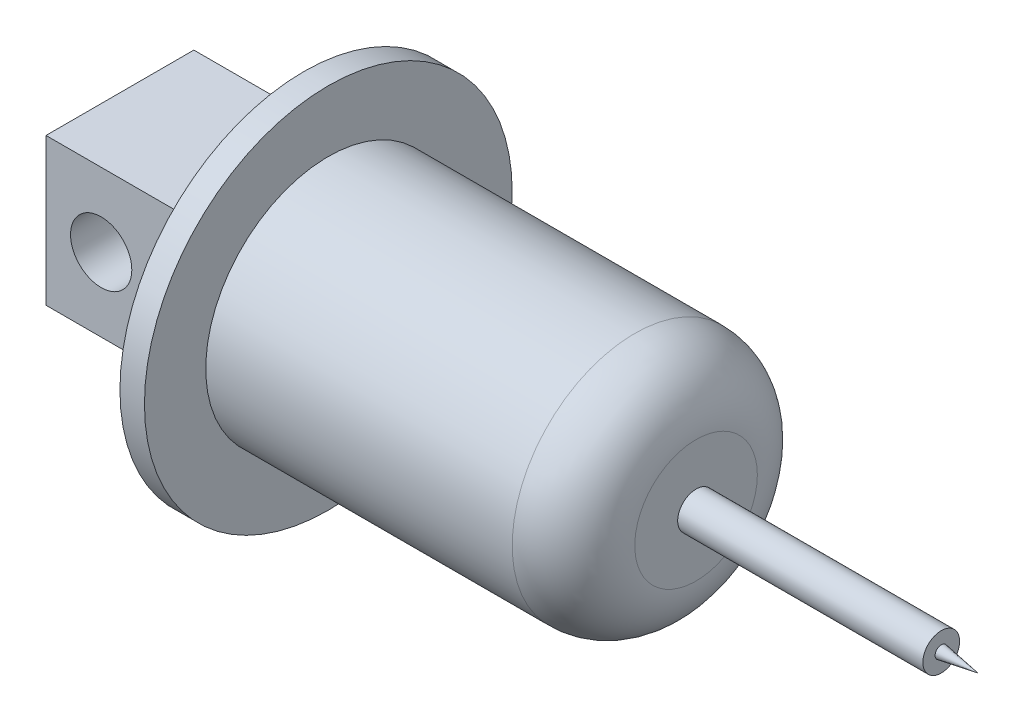
ISO-10303-21;
HEADER;
FILE_DESCRIPTION(('STEP AP214'),'2;1');
FILE_NAME('part.step','',(''),(''),'','','');
FILE_SCHEMA(('AUTOMOTIVE_DESIGN { 1 0 10303 214 1 1 1 1 }'));
ENDSEC;
DATA;
#1=APPLICATION_CONTEXT('core data for automotive mechanical design processes');
#2=APPLICATION_PROTOCOL_DEFINITION('international standard','automotive_design',2000,#1);
#3=PRODUCT_CONTEXT('',#1,'mechanical');
#4=PRODUCT('Part','Part','',(#3));
#5=PRODUCT_RELATED_PRODUCT_CATEGORY('part','',(#4));
#6=PRODUCT_DEFINITION_FORMATION('','',#4);
#7=PRODUCT_DEFINITION_CONTEXT('part definition',#1,'design');
#8=PRODUCT_DEFINITION('design','',#6,#7);
#9=PRODUCT_DEFINITION_SHAPE('','',#8);
#10=(LENGTH_UNIT() NAMED_UNIT(*) SI_UNIT(.MILLI.,.METRE.));
#11=(NAMED_UNIT(*) PLANE_ANGLE_UNIT() SI_UNIT($,.RADIAN.));
#12=(NAMED_UNIT(*) SI_UNIT($,.STERADIAN.) SOLID_ANGLE_UNIT());
#13=UNCERTAINTY_MEASURE_WITH_UNIT(LENGTH_MEASURE(1.E-05),#10,'distance_accuracy_value','');
#14=(GEOMETRIC_REPRESENTATION_CONTEXT(3) GLOBAL_UNCERTAINTY_ASSIGNED_CONTEXT((#13)) GLOBAL_UNIT_ASSIGNED_CONTEXT((#10,
#11,#12)) REPRESENTATION_CONTEXT('',''));
#15=CARTESIAN_POINT('',(0.,0.,0.));
#16=DIRECTION('',(0.,0.,1.));
#17=DIRECTION('',(1.,0.,0.));
#18=AXIS2_PLACEMENT_3D('',#15,#16,#17);
#19=CARTESIAN_POINT('',(-20.,0.,0.));
#20=DIRECTION('',(-1.,0.,0.));
#21=DIRECTION('',(0.,0.,1.));
#22=AXIS2_PLACEMENT_3D('',#19,#20,#21);
#23=CYLINDRICAL_SURFACE('',#22,10.);
#24=CARTESIAN_POINT('',(-25.,0.,0.));
#25=DIRECTION('',(1.,0.,0.));
#26=DIRECTION('',(0.,0.,-1.));
#27=AXIS2_PLACEMENT_3D('',#24,#25,#26);
#28=CIRCLE('',#27,10.);
#29=CARTESIAN_POINT('',(-25.,0.,-9.99999999999991));
#30=VERTEX_POINT('',#29);
#31=EDGE_CURVE('E11',#30,#30,#28,.F.);
#32=ORIENTED_EDGE('',*,*,#31,.T.);
#33=EDGE_LOOP('',(#32));
#34=FACE_BOUND('',#33,.T.);
#35=CARTESIAN_POINT('',(-50.,0.,1.74894432217042E-13));
#36=DIRECTION('',(1.,0.,0.));
#37=DIRECTION('',(0.,0.,-1.));
#38=AXIS2_PLACEMENT_3D('',#35,#36,#37);
#39=CIRCLE('',#38,10.);
#40=CARTESIAN_POINT('',(-50.,0.,-9.99999999999982));
#41=VERTEX_POINT('',#40);
#42=EDGE_CURVE('E166',#41,#41,#39,.T.);
#43=ORIENTED_EDGE('',*,*,#42,.T.);
#44=EDGE_LOOP('',(#43));
#45=FACE_BOUND('',#44,.T.);
#46=ADVANCED_FACE('F33',(#34,#45),#23,.T.);
#47=CARTESIAN_POINT('',(-20.,0.,0.));
#48=DIRECTION('',(1.,0.,0.));
#49=DIRECTION('',(0.,0.,-1.));
#50=AXIS2_PLACEMENT_3D('',#47,#48,#49);
#51=PLANE('',#50);
#52=CARTESIAN_POINT('',(-20.,0.,0.));
#53=DIRECTION('',(1.,0.,0.));
#54=DIRECTION('',(0.,0.,-1.));
#55=AXIS2_PLACEMENT_3D('',#52,#53,#54);
#56=CIRCLE('',#55,1.5);
#57=CARTESIAN_POINT('',(-20.,0.,-1.49999999999993));
#58=VERTEX_POINT('',#57);
#59=EDGE_CURVE('E149',#58,#58,#56,.T.);
#60=ORIENTED_EDGE('',*,*,#59,.F.);
#61=EDGE_LOOP('',(#60));
#62=FACE_BOUND('',#61,.T.);
#63=CARTESIAN_POINT('',(-20.,0.,0.));
#64=DIRECTION('',(1.,0.,0.));
#65=DIRECTION('',(0.,0.,-1.));
#66=AXIS2_PLACEMENT_3D('',#63,#64,#65);
#67=CIRCLE('',#66,5.);
#68=CARTESIAN_POINT('',(-20.,0.,-4.99999999999993));
#69=VERTEX_POINT('',#68);
#70=EDGE_CURVE('E41',#69,#69,#67,.T.);
#71=ORIENTED_EDGE('',*,*,#70,.T.);
#72=EDGE_LOOP('',(#71));
#73=FACE_BOUND('',#72,.T.);
#74=ADVANCED_FACE('F86',(#62,#73),#51,.T.);
#75=CARTESIAN_POINT('',(-52.,0.,1.81877394894729E-13));
#76=DIRECTION('',(1.,0.,0.));
#77=DIRECTION('',(0.,0.,-1.));
#78=AXIS2_PLACEMENT_3D('',#75,#76,#77);
#79=CYLINDRICAL_SURFACE('',#78,15.);
#80=CARTESIAN_POINT('',(-52.,0.,1.81877394894729E-13));
#81=DIRECTION('',(-1.,0.,0.));
#82=DIRECTION('',(0.,0.,1.));
#83=AXIS2_PLACEMENT_3D('',#80,#81,#82);
#84=CIRCLE('',#83,15.);
#85=CARTESIAN_POINT('',(-52.,0.,15.0000000000002));
#86=VERTEX_POINT('',#85);
#87=EDGE_CURVE('E163',#86,#86,#84,.T.);
#88=ORIENTED_EDGE('',*,*,#87,.F.);
#89=EDGE_LOOP('',(#88));
#90=FACE_BOUND('',#89,.T.);
#91=CARTESIAN_POINT('',(-50.,0.,1.74894432217042E-13));
#92=DIRECTION('',(-1.,0.,0.));
#93=DIRECTION('',(0.,0.,1.));
#94=AXIS2_PLACEMENT_3D('',#91,#92,#93);
#95=CIRCLE('',#94,15.);
#96=CARTESIAN_POINT('',(-50.,0.,15.0000000000002));
#97=VERTEX_POINT('',#96);
#98=EDGE_CURVE('E161',#97,#97,#95,.T.);
#99=ORIENTED_EDGE('',*,*,#98,.T.);
#100=EDGE_LOOP('',(#99));
#101=FACE_BOUND('',#100,.T.);
#102=ADVANCED_FACE('F91',(#90,#101),#79,.T.);
#103=CARTESIAN_POINT('',(-52.,0.,1.81877394894729E-13));
#104=DIRECTION('',(-1.,0.,0.));
#105=DIRECTION('',(0.,0.,1.));
#106=AXIS2_PLACEMENT_3D('',#103,#104,#105);
#107=PLANE('',#106);
#108=DIRECTION('',(0.,-1.,0.));
#109=VECTOR('',#108,1.);
#110=CARTESIAN_POINT('',(-52.,-6.,-6.03128939533191));
#111=LINE('',#110,#109);
#112=CARTESIAN_POINT('',(-52.,6.,-6.03128939533191));
#113=VERTEX_POINT('',#112);
#114=CARTESIAN_POINT('',(-52.,-6.,-6.03128939533191));
#115=VERTEX_POINT('',#114);
#116=EDGE_CURVE('E48',#113,#115,#111,.T.);
#117=ORIENTED_EDGE('',*,*,#116,.F.);
#118=DIRECTION('',(0.,0.,-1.));
#119=VECTOR('',#118,1.);
#120=CARTESIAN_POINT('',(-52.,6.,6.03128939533228));
#121=LINE('',#120,#119);
#122=CARTESIAN_POINT('',(-52.,6.,6.03128939533228));
#123=VERTEX_POINT('',#122);
#124=EDGE_CURVE('E52',#123,#113,#121,.T.);
#125=ORIENTED_EDGE('',*,*,#124,.F.);
#126=DIRECTION('',(0.,1.,0.));
#127=VECTOR('',#126,1.);
#128=CARTESIAN_POINT('',(-52.,-6.,6.03128939533228));
#129=LINE('',#128,#127);
#130=CARTESIAN_POINT('',(-52.,-6.,6.03128939533228));
#131=VERTEX_POINT('',#130);
#132=EDGE_CURVE('E276',#131,#123,#129,.T.);
#133=ORIENTED_EDGE('',*,*,#132,.F.);
#134=DIRECTION('',(0.,0.,1.));
#135=VECTOR('',#134,1.);
#136=CARTESIAN_POINT('',(-52.,-6.,6.03128939533228));
#137=LINE('',#136,#135);
#138=EDGE_CURVE('E278',#115,#131,#137,.T.);
#139=ORIENTED_EDGE('',*,*,#138,.F.);
#140=EDGE_LOOP('',(#117,#125,#133,#139));
#141=FACE_BOUND('',#140,.T.);
#142=ORIENTED_EDGE('',*,*,#87,.T.);
#143=EDGE_LOOP('',(#142));
#144=FACE_BOUND('',#143,.T.);
#145=ADVANCED_FACE('F98',(#141,#144),#107,.T.);
#146=CARTESIAN_POINT('',(-50.,0.,1.74894432217042E-13));
#147=DIRECTION('',(-1.,0.,0.));
#148=DIRECTION('',(0.,0.,1.));
#149=AXIS2_PLACEMENT_3D('',#146,#147,#148);
#150=PLANE('',#149);
#151=ORIENTED_EDGE('',*,*,#42,.F.);
#152=EDGE_LOOP('',(#151));
#153=FACE_BOUND('',#152,.T.);
#154=ORIENTED_EDGE('',*,*,#98,.F.);
#155=EDGE_LOOP('',(#154));
#156=FACE_BOUND('',#155,.T.);
#157=ADVANCED_FACE('F100',(#153,#156),#150,.F.);
#158=CARTESIAN_POINT('',(-25.,0.,0.));
#159=DIRECTION('',(1.,0.,0.));
#160=DIRECTION('',(0.,0.,-1.));
#161=AXIS2_PLACEMENT_3D('',#158,#159,#160);
#162=DEGENERATE_TOROIDAL_SURFACE('',#161,5.,5.,.T.);
#163=ORIENTED_EDGE('',*,*,#31,.F.);
#164=EDGE_LOOP('',(#163));
#165=FACE_BOUND('',#164,.T.);
#166=ORIENTED_EDGE('',*,*,#70,.F.);
#167=EDGE_LOOP('',(#166));
#168=FACE_BOUND('',#167,.T.);
#169=ADVANCED_FACE('F35',(#165,#168),#162,.T.);
#170=CARTESIAN_POINT('',(0.,0.,0.));
#171=DIRECTION('',(-1.,0.,0.));
#172=DIRECTION('',(0.,0.,1.));
#173=AXIS2_PLACEMENT_3D('',#170,#171,#172);
#174=CYLINDRICAL_SURFACE('',#173,1.5);
#175=CARTESIAN_POINT('',(0.,0.,0.));
#176=DIRECTION('',(1.,0.,0.));
#177=DIRECTION('',(0.,0.,-1.));
#178=AXIS2_PLACEMENT_3D('',#175,#176,#177);
#179=CIRCLE('',#178,1.5);
#180=CARTESIAN_POINT('',(0.,0.,-1.5));
#181=VERTEX_POINT('',#180);
#182=EDGE_CURVE('E153',#181,#181,#179,.T.);
#183=ORIENTED_EDGE('',*,*,#182,.F.);
#184=EDGE_LOOP('',(#183));
#185=FACE_BOUND('',#184,.T.);
#186=ORIENTED_EDGE('',*,*,#59,.T.);
#187=EDGE_LOOP('',(#186));
#188=FACE_BOUND('',#187,.T.);
#189=ADVANCED_FACE('F106',(#185,#188),#174,.T.);
#190=CARTESIAN_POINT('',(0.,0.,0.));
#191=DIRECTION('',(1.,0.,0.));
#192=DIRECTION('',(0.,0.,-1.));
#193=AXIS2_PLACEMENT_3D('',#190,#191,#192);
#194=PLANE('',#193);
#195=CARTESIAN_POINT('',(0.,0.,0.));
#196=DIRECTION('',(-1.,0.,0.));
#197=DIRECTION('',(0.,0.,1.));
#198=AXIS2_PLACEMENT_3D('',#195,#196,#197);
#199=CIRCLE('',#198,0.5);
#200=CARTESIAN_POINT('',(0.,0.,0.5));
#201=VERTEX_POINT('',#200);
#202=EDGE_CURVE('E291',#201,#201,#199,.T.);
#203=ORIENTED_EDGE('',*,*,#202,.T.);
#204=EDGE_LOOP('',(#203));
#205=FACE_BOUND('',#204,.T.);
#206=ORIENTED_EDGE('',*,*,#182,.T.);
#207=EDGE_LOOP('',(#206));
#208=FACE_BOUND('',#207,.T.);
#209=ADVANCED_FACE('F109',(#205,#208),#194,.T.);
#210=CARTESIAN_POINT('',(-67.,-6.,-6.03128939533186));
#211=DIRECTION('',(0.,0.,1.));
#212=DIRECTION('',(1.,0.,0.));
#213=AXIS2_PLACEMENT_3D('',#210,#211,#212);
#214=PLANE('',#213);
#215=CARTESIAN_POINT('',(-62.5,0.,-6.03128939533188));
#216=DIRECTION('',(0.,0.,1.));
#217=DIRECTION('',(1.,0.,0.));
#218=AXIS2_PLACEMENT_3D('',#215,#216,#217);
#219=CIRCLE('',#218,2.5);
#220=CARTESIAN_POINT('',(-60.,0.,-6.03128939533189));
#221=VERTEX_POINT('',#220);
#222=EDGE_CURVE('E281',#221,#221,#219,.T.);
#223=ORIENTED_EDGE('',*,*,#222,.T.);
#224=EDGE_LOOP('',(#223));
#225=FACE_BOUND('',#224,.T.);
#226=ORIENTED_EDGE('',*,*,#116,.T.);
#227=DIRECTION('',(1.,0.,0.));
#228=VECTOR('',#227,1.);
#229=CARTESIAN_POINT('',(-67.,-6.,-6.03128939533186));
#230=LINE('',#229,#228);
#231=CARTESIAN_POINT('',(-67.,-6.,-6.03128939533186));
#232=VERTEX_POINT('',#231);
#233=EDGE_CURVE('E147',#232,#115,#230,.T.);
#234=ORIENTED_EDGE('',*,*,#233,.F.);
#235=DIRECTION('',(0.,-1.,0.));
#236=VECTOR('',#235,1.);
#237=CARTESIAN_POINT('',(-67.,-6.,-6.03128939533186));
#238=LINE('',#237,#236);
#239=CARTESIAN_POINT('',(-67.,6.,-6.03128939533186));
#240=VERTEX_POINT('',#239);
#241=EDGE_CURVE('E136',#240,#232,#238,.T.);
#242=ORIENTED_EDGE('',*,*,#241,.F.);
#243=DIRECTION('',(1.,0.,0.));
#244=VECTOR('',#243,1.);
#245=CARTESIAN_POINT('',(-67.,6.,-6.03128939533186));
#246=LINE('',#245,#244);
#247=EDGE_CURVE('E273',#240,#113,#246,.T.);
#248=ORIENTED_EDGE('',*,*,#247,.T.);
#249=EDGE_LOOP('',(#226,#234,#242,#248));
#250=FACE_BOUND('',#249,.T.);
#251=ADVANCED_FACE('F113',(#225,#250),#214,.F.);
#252=CARTESIAN_POINT('',(-67.,-6.,6.03128939533233));
#253=DIRECTION('',(0.,1.,0.));
#254=DIRECTION('',(0.,0.,1.));
#255=AXIS2_PLACEMENT_3D('',#252,#253,#254);
#256=PLANE('',#255);
#257=ORIENTED_EDGE('',*,*,#138,.T.);
#258=DIRECTION('',(1.,0.,0.));
#259=VECTOR('',#258,1.);
#260=CARTESIAN_POINT('',(-67.,-6.,6.03128939533233));
#261=LINE('',#260,#259);
#262=CARTESIAN_POINT('',(-67.,-6.,6.03128939533233));
#263=VERTEX_POINT('',#262);
#264=EDGE_CURVE('E150',#263,#131,#261,.T.);
#265=ORIENTED_EDGE('',*,*,#264,.F.);
#266=DIRECTION('',(0.,0.,1.));
#267=VECTOR('',#266,1.);
#268=CARTESIAN_POINT('',(-67.,-6.,6.03128939533233));
#269=LINE('',#268,#267);
#270=EDGE_CURVE('E138',#232,#263,#269,.T.);
#271=ORIENTED_EDGE('',*,*,#270,.F.);
#272=ORIENTED_EDGE('',*,*,#233,.T.);
#273=EDGE_LOOP('',(#257,#265,#271,#272));
#274=FACE_BOUND('',#273,.T.);
#275=ADVANCED_FACE('F117',(#274),#256,.F.);
#276=CARTESIAN_POINT('',(-67.,-6.,6.03128939533233));
#277=DIRECTION('',(0.,0.,-1.));
#278=DIRECTION('',(-1.,0.,0.));
#279=AXIS2_PLACEMENT_3D('',#276,#277,#278);
#280=PLANE('',#279);
#281=CARTESIAN_POINT('',(-62.5,0.,6.03128939533231));
#282=DIRECTION('',(0.,0.,1.));
#283=DIRECTION('',(1.,0.,0.));
#284=AXIS2_PLACEMENT_3D('',#281,#282,#283);
#285=CIRCLE('',#284,2.5);
#286=CARTESIAN_POINT('',(-60.,0.,6.0312893953323));
#287=VERTEX_POINT('',#286);
#288=EDGE_CURVE('E288',#287,#287,#285,.T.);
#289=ORIENTED_EDGE('',*,*,#288,.F.);
#290=EDGE_LOOP('',(#289));
#291=FACE_BOUND('',#290,.T.);
#292=ORIENTED_EDGE('',*,*,#132,.T.);
#293=DIRECTION('',(1.,0.,0.));
#294=VECTOR('',#293,1.);
#295=CARTESIAN_POINT('',(-67.,6.,6.03128939533233));
#296=LINE('',#295,#294);
#297=CARTESIAN_POINT('',(-67.,6.,6.03128939533233));
#298=VERTEX_POINT('',#297);
#299=EDGE_CURVE('E156',#298,#123,#296,.T.);
#300=ORIENTED_EDGE('',*,*,#299,.F.);
#301=DIRECTION('',(0.,1.,0.));
#302=VECTOR('',#301,1.);
#303=CARTESIAN_POINT('',(-67.,-6.,6.03128939533233));
#304=LINE('',#303,#302);
#305=EDGE_CURVE('E283',#263,#298,#304,.T.);
#306=ORIENTED_EDGE('',*,*,#305,.F.);
#307=ORIENTED_EDGE('',*,*,#264,.T.);
#308=EDGE_LOOP('',(#292,#300,#306,#307));
#309=FACE_BOUND('',#308,.T.);
#310=ADVANCED_FACE('F121',(#291,#309),#280,.F.);
#311=CARTESIAN_POINT('',(-67.,6.,6.03128939533233));
#312=DIRECTION('',(0.,-1.,0.));
#313=DIRECTION('',(0.,0.,-1.));
#314=AXIS2_PLACEMENT_3D('',#311,#312,#313);
#315=PLANE('',#314);
#316=ORIENTED_EDGE('',*,*,#124,.T.);
#317=ORIENTED_EDGE('',*,*,#247,.F.);
#318=DIRECTION('',(0.,0.,-1.));
#319=VECTOR('',#318,1.);
#320=CARTESIAN_POINT('',(-67.,6.,6.03128939533233));
#321=LINE('',#320,#319);
#322=EDGE_CURVE('E141',#298,#240,#321,.T.);
#323=ORIENTED_EDGE('',*,*,#322,.F.);
#324=ORIENTED_EDGE('',*,*,#299,.T.);
#325=EDGE_LOOP('',(#316,#317,#323,#324));
#326=FACE_BOUND('',#325,.T.);
#327=ADVANCED_FACE('F125',(#326),#315,.F.);
#328=CARTESIAN_POINT('',(-67.,0.,2.34249614977376E-13));
#329=DIRECTION('',(-1.,0.,0.));
#330=DIRECTION('',(0.,0.,1.));
#331=AXIS2_PLACEMENT_3D('',#328,#329,#330);
#332=PLANE('',#331);
#333=ORIENTED_EDGE('',*,*,#241,.T.);
#334=ORIENTED_EDGE('',*,*,#270,.T.);
#335=ORIENTED_EDGE('',*,*,#305,.T.);
#336=ORIENTED_EDGE('',*,*,#322,.T.);
#337=EDGE_LOOP('',(#333,#334,#335,#336));
#338=FACE_BOUND('',#337,.T.);
#339=ADVANCED_FACE('F81',(#338),#332,.T.);
#340=CARTESIAN_POINT('',(-62.5000000000001,0.,-14.9999999999998));
#341=DIRECTION('',(0.,0.,1.));
#342=DIRECTION('',(1.,0.,0.));
#343=AXIS2_PLACEMENT_3D('',#340,#341,#342);
#344=CYLINDRICAL_SURFACE('',#343,2.5);
#345=ORIENTED_EDGE('',*,*,#288,.T.);
#346=EDGE_LOOP('',(#345));
#347=FACE_BOUND('',#346,.T.);
#348=ORIENTED_EDGE('',*,*,#222,.F.);
#349=EDGE_LOOP('',(#348));
#350=FACE_BOUND('',#349,.T.);
#351=ADVANCED_FACE('F75',(#347,#350),#344,.F.);
#352=CARTESIAN_POINT('',(3.,0.,0.));
#353=DIRECTION('',(-1.,0.,0.));
#354=DIRECTION('',(0.,0.,1.));
#355=AXIS2_PLACEMENT_3D('',#352,#353,#354);
#356=CONICAL_SURFACE('',#355,0.,0.165148677414627);
#357=ORIENTED_EDGE('',*,*,#202,.F.);
#358=EDGE_LOOP('',(#357));
#359=FACE_BOUND('',#358,.T.);
#360=CARTESIAN_POINT('',(3.,0.,0.));
#361=VERTEX_POINT('',#360);
#362=VERTEX_LOOP('',#361);
#363=FACE_BOUND('',#362,.T.);
#364=ADVANCED_FACE('F73',(#359,#363),#356,.T.);
#365=CLOSED_SHELL('',(#46,#74,#102,#145,#157,#169,#189,#209,#251,#275,#310,#327,#339,#351,#364));
#366=MANIFOLD_SOLID_BREP('B2',#365);
#367=ADVANCED_BREP_SHAPE_REPRESENTATION('',(#18,#366),#14);
#368=SHAPE_DEFINITION_REPRESENTATION(#9,#367);
ENDSEC;
END-ISO-10303-21;
